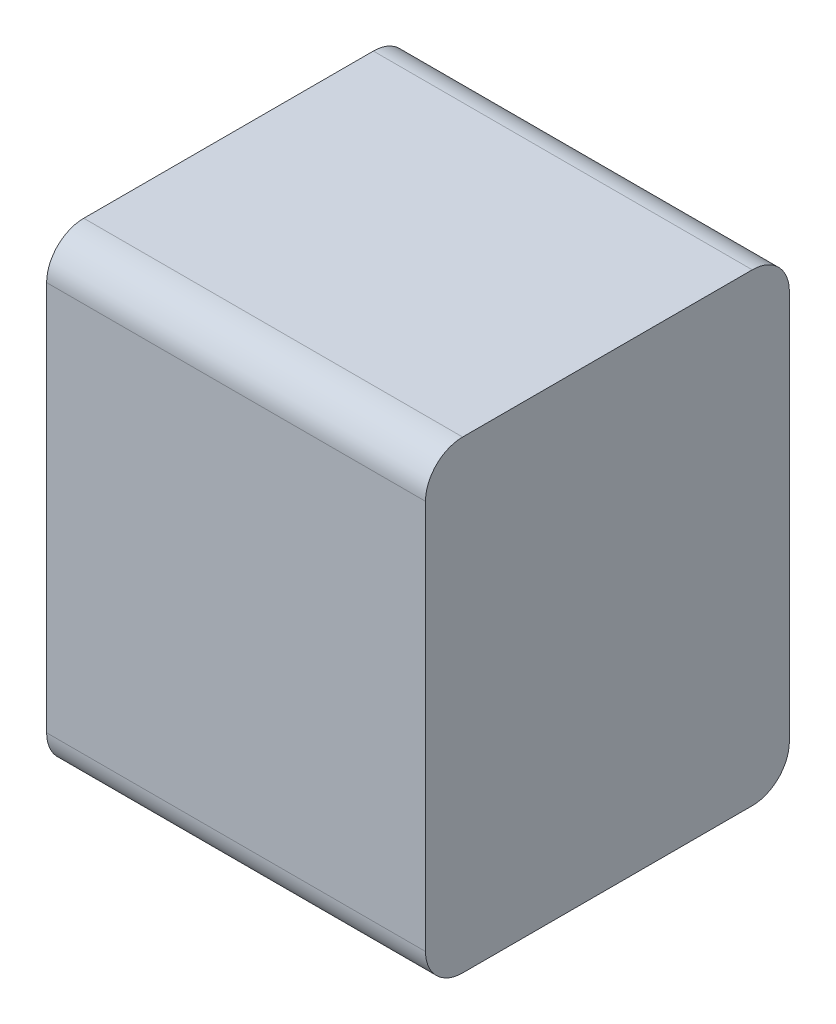
ISO-10303-21;
HEADER;
FILE_DESCRIPTION(('STEP AP214'),'2;1');
FILE_NAME('part.step','',(''),(''),'','','');
FILE_SCHEMA(('AUTOMOTIVE_DESIGN { 1 0 10303 214 1 1 1 1 }'));
ENDSEC;
DATA;
#1=APPLICATION_CONTEXT('core data for automotive mechanical design processes');
#2=APPLICATION_PROTOCOL_DEFINITION('international standard','automotive_design',2000,#1);
#3=PRODUCT_CONTEXT('',#1,'mechanical');
#4=PRODUCT('Part','Part','',(#3));
#5=PRODUCT_RELATED_PRODUCT_CATEGORY('part','',(#4));
#6=PRODUCT_DEFINITION_FORMATION('','',#4);
#7=PRODUCT_DEFINITION_CONTEXT('part definition',#1,'design');
#8=PRODUCT_DEFINITION('design','',#6,#7);
#9=PRODUCT_DEFINITION_SHAPE('','',#8);
#10=(LENGTH_UNIT() NAMED_UNIT(*) SI_UNIT(.MILLI.,.METRE.));
#11=(NAMED_UNIT(*) PLANE_ANGLE_UNIT() SI_UNIT($,.RADIAN.));
#12=(NAMED_UNIT(*) SI_UNIT($,.STERADIAN.) SOLID_ANGLE_UNIT());
#13=UNCERTAINTY_MEASURE_WITH_UNIT(LENGTH_MEASURE(1.E-05),#10,'distance_accuracy_value','');
#14=(GEOMETRIC_REPRESENTATION_CONTEXT(3) GLOBAL_UNCERTAINTY_ASSIGNED_CONTEXT((#13)) GLOBAL_UNIT_ASSIGNED_CONTEXT((#10,
#11,#12)) REPRESENTATION_CONTEXT('',''));
#15=CARTESIAN_POINT('',(0.,0.,0.));
#16=DIRECTION('',(0.,0.,1.));
#17=DIRECTION('',(1.,0.,0.));
#18=AXIS2_PLACEMENT_3D('',#15,#16,#17);
#19=CARTESIAN_POINT('',(-0.5,-0.6125,0.0098));
#20=DIRECTION('',(1.,0.,0.));
#21=DIRECTION('',(0.,0.,1.));
#22=AXIS2_PLACEMENT_3D('',#19,#20,#21);
#23=PLANE('',#22);
#24=CARTESIAN_POINT('',(-0.5,-0.5145,0.8722));
#25=DIRECTION('',(-1.,0.,0.));
#26=DIRECTION('',(0.,0.,1.));
#27=AXIS2_PLACEMENT_3D('',#24,#25,#26);
#28=CIRCLE('',#27,0.098);
#29=CARTESIAN_POINT('',(-0.5,-0.6125,0.8722));
#30=VERTEX_POINT('',#29);
#31=CARTESIAN_POINT('',(-0.5,-0.5145,0.9702));
#32=VERTEX_POINT('',#31);
#33=EDGE_CURVE('E11',#30,#32,#28,.T.);
#34=ORIENTED_EDGE('',*,*,#33,.T.);
#35=DIRECTION('',(0.,1.,0.));
#36=VECTOR('',#35,1.);
#37=CARTESIAN_POINT('',(-0.5,-0.6125,0.9702));
#38=LINE('',#37,#36);
#39=CARTESIAN_POINT('',(-0.5,0.5145,0.9702));
#40=VERTEX_POINT('',#39);
#41=EDGE_CURVE('E24',#32,#40,#38,.T.);
#42=ORIENTED_EDGE('',*,*,#41,.T.);
#43=CARTESIAN_POINT('',(-0.5,0.5145,0.8722));
#44=DIRECTION('',(1.,0.,0.));
#45=DIRECTION('',(0.,0.,1.));
#46=AXIS2_PLACEMENT_3D('',#43,#44,#45);
#47=CIRCLE('',#46,0.098);
#48=CARTESIAN_POINT('',(-0.5,0.6125,0.8722));
#49=VERTEX_POINT('',#48);
#50=EDGE_CURVE('E143',#49,#40,#47,.T.);
#51=ORIENTED_EDGE('',*,*,#50,.F.);
#52=DIRECTION('',(0.,0.,1.));
#53=VECTOR('',#52,1.);
#54=CARTESIAN_POINT('',(-0.5,0.6125,0.0098));
#55=LINE('',#54,#53);
#56=CARTESIAN_POINT('',(-0.5,0.6125,0.1078));
#57=VERTEX_POINT('',#56);
#58=EDGE_CURVE('E98',#57,#49,#55,.T.);
#59=ORIENTED_EDGE('',*,*,#58,.F.);
#60=CARTESIAN_POINT('',(-0.5,0.5145,0.1078));
#61=DIRECTION('',(-1.,0.,0.));
#62=DIRECTION('',(0.,0.,1.));
#63=AXIS2_PLACEMENT_3D('',#60,#61,#62);
#64=CIRCLE('',#63,0.098);
#65=CARTESIAN_POINT('',(-0.5,0.5145,0.0098));
#66=VERTEX_POINT('',#65);
#67=EDGE_CURVE('E139',#57,#66,#64,.T.);
#68=ORIENTED_EDGE('',*,*,#67,.T.);
#69=DIRECTION('',(0.,1.,0.));
#70=VECTOR('',#69,1.);
#71=CARTESIAN_POINT('',(-0.5,-0.6125,0.0098));
#72=LINE('',#71,#70);
#73=CARTESIAN_POINT('',(-0.5,-0.5145,0.0098));
#74=VERTEX_POINT('',#73);
#75=EDGE_CURVE('E137',#74,#66,#72,.T.);
#76=ORIENTED_EDGE('',*,*,#75,.F.);
#77=CARTESIAN_POINT('',(-0.5,-0.5145,0.1078));
#78=DIRECTION('',(1.,0.,0.));
#79=DIRECTION('',(0.,0.,1.));
#80=AXIS2_PLACEMENT_3D('',#77,#78,#79);
#81=CIRCLE('',#80,0.098);
#82=CARTESIAN_POINT('',(-0.5,-0.6125,0.1078));
#83=VERTEX_POINT('',#82);
#84=EDGE_CURVE('E135',#83,#74,#81,.T.);
#85=ORIENTED_EDGE('',*,*,#84,.F.);
#86=DIRECTION('',(0.,0.,1.));
#87=VECTOR('',#86,1.);
#88=CARTESIAN_POINT('',(-0.5,-0.6125,0.0098));
#89=LINE('',#88,#87);
#90=EDGE_CURVE('E36',#83,#30,#89,.T.);
#91=ORIENTED_EDGE('',*,*,#90,.T.);
#92=EDGE_LOOP('',(#34,#42,#51,#59,#68,#76,#85,#91));
#93=FACE_BOUND('',#92,.T.);
#94=ADVANCED_FACE('F17',(#93),#23,.F.);
#95=CARTESIAN_POINT('',(-0.5,-0.6125,0.0098));
#96=DIRECTION('',(0.,1.,0.));
#97=DIRECTION('',(0.,0.,1.));
#98=AXIS2_PLACEMENT_3D('',#95,#96,#97);
#99=PLANE('',#98);
#100=DIRECTION('',(1.,0.,0.));
#101=VECTOR('',#100,1.);
#102=CARTESIAN_POINT('',(-0.5,-0.6125,0.8722));
#103=LINE('',#102,#101);
#104=CARTESIAN_POINT('',(0.5,-0.6125,0.8722));
#105=VERTEX_POINT('',#104);
#106=EDGE_CURVE('E131',#30,#105,#103,.T.);
#107=ORIENTED_EDGE('',*,*,#106,.F.);
#108=ORIENTED_EDGE('',*,*,#90,.F.);
#109=DIRECTION('',(1.,0.,0.));
#110=VECTOR('',#109,1.);
#111=CARTESIAN_POINT('',(-0.5,-0.6125,0.1078));
#112=LINE('',#111,#110);
#113=CARTESIAN_POINT('',(0.5,-0.6125,0.1078));
#114=VERTEX_POINT('',#113);
#115=EDGE_CURVE('E128',#83,#114,#112,.T.);
#116=ORIENTED_EDGE('',*,*,#115,.T.);
#117=DIRECTION('',(0.,0.,1.));
#118=VECTOR('',#117,1.);
#119=CARTESIAN_POINT('',(0.5,-0.6125,0.0098));
#120=LINE('',#119,#118);
#121=EDGE_CURVE('E126',#114,#105,#120,.T.);
#122=ORIENTED_EDGE('',*,*,#121,.T.);
#123=EDGE_LOOP('',(#107,#108,#116,#122));
#124=FACE_BOUND('',#123,.T.);
#125=ADVANCED_FACE('F151',(#124),#99,.F.);
#126=CARTESIAN_POINT('',(-0.5,-0.5145,0.1078));
#127=DIRECTION('',(1.,0.,0.));
#128=DIRECTION('',(0.,-1.,0.));
#129=AXIS2_PLACEMENT_3D('',#126,#127,#128);
#130=CYLINDRICAL_SURFACE('',#129,0.098);
#131=ORIENTED_EDGE('',*,*,#84,.T.);
#132=DIRECTION('',(1.,0.,0.));
#133=VECTOR('',#132,1.);
#134=CARTESIAN_POINT('',(-0.5,-0.5145,0.0098));
#135=LINE('',#134,#133);
#136=CARTESIAN_POINT('',(0.5,-0.5145,0.0098));
#137=VERTEX_POINT('',#136);
#138=EDGE_CURVE('E124',#74,#137,#135,.T.);
#139=ORIENTED_EDGE('',*,*,#138,.T.);
#140=CARTESIAN_POINT('',(0.5,-0.5145,0.1078));
#141=DIRECTION('',(1.,0.,0.));
#142=DIRECTION('',(0.,0.,1.));
#143=AXIS2_PLACEMENT_3D('',#140,#141,#142);
#144=CIRCLE('',#143,0.098);
#145=EDGE_CURVE('E121',#114,#137,#144,.T.);
#146=ORIENTED_EDGE('',*,*,#145,.F.);
#147=ORIENTED_EDGE('',*,*,#115,.F.);
#148=EDGE_LOOP('',(#131,#139,#146,#147));
#149=FACE_BOUND('',#148,.T.);
#150=ADVANCED_FACE('F155',(#149),#130,.T.);
#151=CARTESIAN_POINT('',(-0.5,-0.5145,0.8722));
#152=DIRECTION('',(1.,0.,0.));
#153=DIRECTION('',(0.,-1.,0.));
#154=AXIS2_PLACEMENT_3D('',#151,#152,#153);
#155=CYLINDRICAL_SURFACE('',#154,0.098);
#156=ORIENTED_EDGE('',*,*,#106,.T.);
#157=CARTESIAN_POINT('',(0.5,-0.5145,0.8722));
#158=DIRECTION('',(-1.,0.,0.));
#159=DIRECTION('',(0.,0.,1.));
#160=AXIS2_PLACEMENT_3D('',#157,#158,#159);
#161=CIRCLE('',#160,0.098);
#162=CARTESIAN_POINT('',(0.5,-0.5145,0.9702));
#163=VERTEX_POINT('',#162);
#164=EDGE_CURVE('E119',#105,#163,#161,.T.);
#165=ORIENTED_EDGE('',*,*,#164,.T.);
#166=DIRECTION('',(1.,0.,0.));
#167=VECTOR('',#166,1.);
#168=CARTESIAN_POINT('',(-0.5,-0.5145,0.9702));
#169=LINE('',#168,#167);
#170=EDGE_CURVE('E117',#32,#163,#169,.T.);
#171=ORIENTED_EDGE('',*,*,#170,.F.);
#172=ORIENTED_EDGE('',*,*,#33,.F.);
#173=EDGE_LOOP('',(#156,#165,#171,#172));
#174=FACE_BOUND('',#173,.T.);
#175=ADVANCED_FACE('F148',(#174),#155,.T.);
#176=CARTESIAN_POINT('',(-0.5,-0.6125,0.0098));
#177=DIRECTION('',(0.,0.,1.));
#178=DIRECTION('',(1.,0.,0.));
#179=AXIS2_PLACEMENT_3D('',#176,#177,#178);
#180=PLANE('',#179);
#181=DIRECTION('',(1.,0.,0.));
#182=VECTOR('',#181,1.);
#183=CARTESIAN_POINT('',(-0.5,0.5145,0.0098));
#184=LINE('',#183,#182);
#185=CARTESIAN_POINT('',(0.5,0.5145,0.0098));
#186=VERTEX_POINT('',#185);
#187=EDGE_CURVE('E114',#66,#186,#184,.T.);
#188=ORIENTED_EDGE('',*,*,#187,.T.);
#189=DIRECTION('',(0.,1.,0.));
#190=VECTOR('',#189,1.);
#191=CARTESIAN_POINT('',(0.5,-0.6125,0.0098));
#192=LINE('',#191,#190);
#193=EDGE_CURVE('E112',#137,#186,#192,.T.);
#194=ORIENTED_EDGE('',*,*,#193,.F.);
#195=ORIENTED_EDGE('',*,*,#138,.F.);
#196=ORIENTED_EDGE('',*,*,#75,.T.);
#197=EDGE_LOOP('',(#188,#194,#195,#196));
#198=FACE_BOUND('',#197,.T.);
#199=ADVANCED_FACE('F159',(#198),#180,.F.);
#200=CARTESIAN_POINT('',(-0.5,-0.6125,0.9702));
#201=DIRECTION('',(0.,0.,1.));
#202=DIRECTION('',(1.,0.,0.));
#203=AXIS2_PLACEMENT_3D('',#200,#201,#202);
#204=PLANE('',#203);
#205=ORIENTED_EDGE('',*,*,#41,.F.);
#206=ORIENTED_EDGE('',*,*,#170,.T.);
#207=DIRECTION('',(0.,1.,0.));
#208=VECTOR('',#207,1.);
#209=CARTESIAN_POINT('',(0.5,-0.6125,0.9702));
#210=LINE('',#209,#208);
#211=CARTESIAN_POINT('',(0.5,0.5145,0.9702));
#212=VERTEX_POINT('',#211);
#213=EDGE_CURVE('E110',#163,#212,#210,.T.);
#214=ORIENTED_EDGE('',*,*,#213,.T.);
#215=DIRECTION('',(1.,0.,0.));
#216=VECTOR('',#215,1.);
#217=CARTESIAN_POINT('',(-0.5,0.5145,0.9702));
#218=LINE('',#217,#216);
#219=EDGE_CURVE('E86',#40,#212,#218,.T.);
#220=ORIENTED_EDGE('',*,*,#219,.F.);
#221=EDGE_LOOP('',(#205,#206,#214,#220));
#222=FACE_BOUND('',#221,.T.);
#223=ADVANCED_FACE('F145',(#222),#204,.T.);
#224=CARTESIAN_POINT('',(-0.5,0.5145,0.1078));
#225=DIRECTION('',(1.,0.,0.));
#226=DIRECTION('',(0.,1.,0.));
#227=AXIS2_PLACEMENT_3D('',#224,#225,#226);
#228=CYLINDRICAL_SURFACE('',#227,0.098);
#229=DIRECTION('',(1.,0.,0.));
#230=VECTOR('',#229,1.);
#231=CARTESIAN_POINT('',(-0.5,0.6125,0.1078));
#232=LINE('',#231,#230);
#233=CARTESIAN_POINT('',(0.5,0.6125,0.1078));
#234=VERTEX_POINT('',#233);
#235=EDGE_CURVE('E107',#57,#234,#232,.T.);
#236=ORIENTED_EDGE('',*,*,#235,.T.);
#237=CARTESIAN_POINT('',(0.5,0.5145,0.1078));
#238=DIRECTION('',(-1.,0.,0.));
#239=DIRECTION('',(0.,0.,1.));
#240=AXIS2_PLACEMENT_3D('',#237,#238,#239);
#241=CIRCLE('',#240,0.098);
#242=EDGE_CURVE('E90',#234,#186,#241,.T.);
#243=ORIENTED_EDGE('',*,*,#242,.T.);
#244=ORIENTED_EDGE('',*,*,#187,.F.);
#245=ORIENTED_EDGE('',*,*,#67,.F.);
#246=EDGE_LOOP('',(#236,#243,#244,#245));
#247=FACE_BOUND('',#246,.T.);
#248=ADVANCED_FACE('F163',(#247),#228,.T.);
#249=CARTESIAN_POINT('',(-0.5,0.5145,0.8722));
#250=DIRECTION('',(1.,0.,0.));
#251=DIRECTION('',(0.,1.,0.));
#252=AXIS2_PLACEMENT_3D('',#249,#250,#251);
#253=CYLINDRICAL_SURFACE('',#252,0.098);
#254=ORIENTED_EDGE('',*,*,#50,.T.);
#255=ORIENTED_EDGE('',*,*,#219,.T.);
#256=CARTESIAN_POINT('',(0.5,0.5145,0.8722));
#257=DIRECTION('',(1.,0.,0.));
#258=DIRECTION('',(0.,0.,1.));
#259=AXIS2_PLACEMENT_3D('',#256,#257,#258);
#260=CIRCLE('',#259,0.098);
#261=CARTESIAN_POINT('',(0.5,0.6125,0.8722));
#262=VERTEX_POINT('',#261);
#263=EDGE_CURVE('E82',#262,#212,#260,.T.);
#264=ORIENTED_EDGE('',*,*,#263,.F.);
#265=DIRECTION('',(1.,0.,0.));
#266=VECTOR('',#265,1.);
#267=CARTESIAN_POINT('',(-0.5,0.6125,0.8722));
#268=LINE('',#267,#266);
#269=EDGE_CURVE('E85',#49,#262,#268,.T.);
#270=ORIENTED_EDGE('',*,*,#269,.F.);
#271=EDGE_LOOP('',(#254,#255,#264,#270));
#272=FACE_BOUND('',#271,.T.);
#273=ADVANCED_FACE('F84',(#272),#253,.T.);
#274=CARTESIAN_POINT('',(-0.5,0.6125,0.0098));
#275=DIRECTION('',(0.,1.,0.));
#276=DIRECTION('',(0.,0.,1.));
#277=AXIS2_PLACEMENT_3D('',#274,#275,#276);
#278=PLANE('',#277);
#279=DIRECTION('',(0.,0.,1.));
#280=VECTOR('',#279,1.);
#281=CARTESIAN_POINT('',(0.5,0.6125,0.0098));
#282=LINE('',#281,#280);
#283=EDGE_CURVE('E96',#234,#262,#282,.T.);
#284=ORIENTED_EDGE('',*,*,#283,.F.);
#285=ORIENTED_EDGE('',*,*,#235,.F.);
#286=ORIENTED_EDGE('',*,*,#58,.T.);
#287=ORIENTED_EDGE('',*,*,#269,.T.);
#288=EDGE_LOOP('',(#284,#285,#286,#287));
#289=FACE_BOUND('',#288,.T.);
#290=ADVANCED_FACE('F94',(#289),#278,.T.);
#291=CARTESIAN_POINT('',(0.5,-0.6125,0.0098));
#292=DIRECTION('',(1.,0.,0.));
#293=DIRECTION('',(0.,0.,1.));
#294=AXIS2_PLACEMENT_3D('',#291,#292,#293);
#295=PLANE('',#294);
#296=ORIENTED_EDGE('',*,*,#121,.F.);
#297=ORIENTED_EDGE('',*,*,#145,.T.);
#298=ORIENTED_EDGE('',*,*,#193,.T.);
#299=ORIENTED_EDGE('',*,*,#242,.F.);
#300=ORIENTED_EDGE('',*,*,#283,.T.);
#301=ORIENTED_EDGE('',*,*,#263,.T.);
#302=ORIENTED_EDGE('',*,*,#213,.F.);
#303=ORIENTED_EDGE('',*,*,#164,.F.);
#304=EDGE_LOOP('',(#296,#297,#298,#299,#300,#301,#302,#303));
#305=FACE_BOUND('',#304,.T.);
#306=ADVANCED_FACE('F102',(#305),#295,.T.);
#307=CLOSED_SHELL('',(#94,#125,#150,#175,#199,#223,#248,#273,#290,#306));
#308=MANIFOLD_SOLID_BREP('B1',#307);
#309=ADVANCED_BREP_SHAPE_REPRESENTATION('',(#18,#308),#14);
#310=SHAPE_DEFINITION_REPRESENTATION(#9,#309);
ENDSEC;
END-ISO-10303-21;
